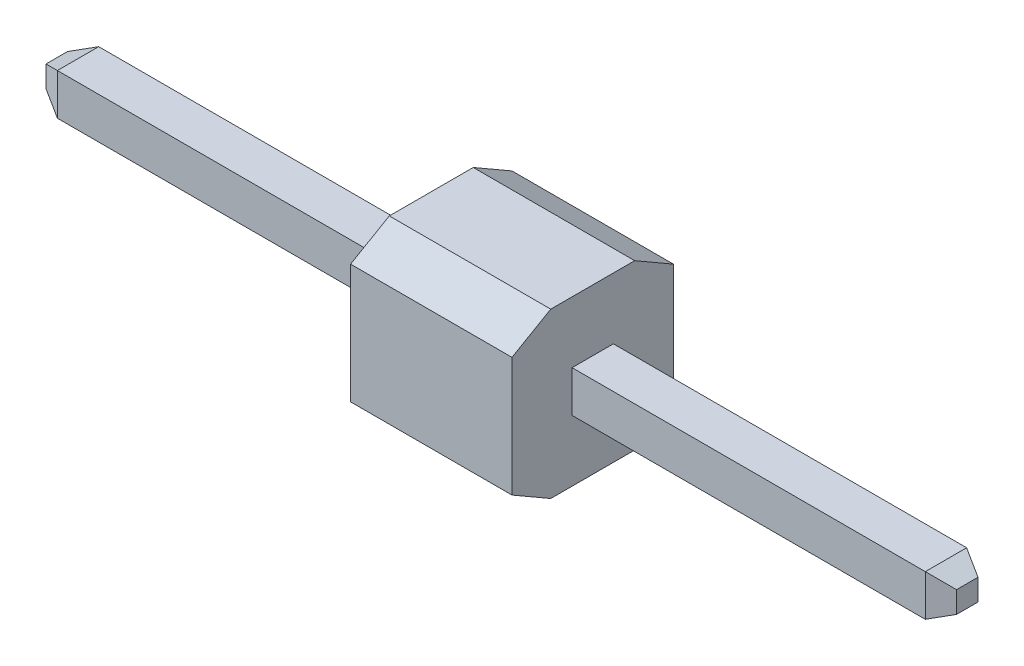
ISO-10303-21;
HEADER;
FILE_DESCRIPTION(('STEP AP214'),'2;1');
FILE_NAME('part.step','',(''),(''),'','','');
FILE_SCHEMA(('AUTOMOTIVE_DESIGN { 1 0 10303 214 1 1 1 1 }'));
ENDSEC;
DATA;
#1=APPLICATION_CONTEXT('core data for automotive mechanical design processes');
#2=APPLICATION_PROTOCOL_DEFINITION('international standard','automotive_design',2000,#1);
#3=PRODUCT_CONTEXT('',#1,'mechanical');
#4=PRODUCT('Part','Part','',(#3));
#5=PRODUCT_RELATED_PRODUCT_CATEGORY('part','',(#4));
#6=PRODUCT_DEFINITION_FORMATION('','',#4);
#7=PRODUCT_DEFINITION_CONTEXT('part definition',#1,'design');
#8=PRODUCT_DEFINITION('design','',#6,#7);
#9=PRODUCT_DEFINITION_SHAPE('','',#8);
#10=(LENGTH_UNIT() NAMED_UNIT(*) SI_UNIT(.MILLI.,.METRE.));
#11=(NAMED_UNIT(*) PLANE_ANGLE_UNIT() SI_UNIT($,.RADIAN.));
#12=(NAMED_UNIT(*) SI_UNIT($,.STERADIAN.) SOLID_ANGLE_UNIT());
#13=UNCERTAINTY_MEASURE_WITH_UNIT(LENGTH_MEASURE(1.E-05),#10,'distance_accuracy_value','');
#14=(GEOMETRIC_REPRESENTATION_CONTEXT(3) GLOBAL_UNCERTAINTY_ASSIGNED_CONTEXT((#13)) GLOBAL_UNIT_ASSIGNED_CONTEXT((#10,
#11,#12)) REPRESENTATION_CONTEXT('',''));
#15=CARTESIAN_POINT('',(0.,0.,0.));
#16=DIRECTION('',(0.,0.,1.));
#17=DIRECTION('',(1.,0.,0.));
#18=AXIS2_PLACEMENT_3D('',#15,#16,#17);
#19=CARTESIAN_POINT('',(5.42105009956526,-7.30287855189696,-2.6299975882472));
#20=DIRECTION('',(1.,-9.93476518829084E-08,4.37113882867379E-08));
#21=DIRECTION('',(-9.93476589883358E-08,-1.,8.74227765734759E-08));
#22=AXIS2_PLACEMENT_3D('',#19,#20,#21);
#23=PLANE('',#22);
#24=DIRECTION('',(-1.18186619959243E-08,-0.500000075710538,-0.866025360072935));
#25=VECTOR('',#24,1.);
#26=CARTESIAN_POINT('',(5.42104990739065,-8.54646825312919,-1.05999747952913));
#27=LINE('',#26,#25);
#28=CARTESIAN_POINT('',(5.42104990739065,-8.54646825312919,-1.05999747952913));
#29=VERTEX_POINT('',#28);
#30=CARTESIAN_POINT('',(5.42104989920244,-8.89287846709686,-1.65999744924499));
#31=VERTEX_POINT('',#30);
#32=EDGE_CURVE('E11',#29,#31,#27,.T.);
#33=ORIENTED_EDGE('',*,*,#32,.T.);
#34=DIRECTION('',(4.37113811813104E-08,-8.74227842254741E-08,-0.999999999999995));
#35=VECTOR('',#34,1.);
#36=CARTESIAN_POINT('',(5.42104989920244,-8.89287846709686,-1.65999744924499));
#37=LINE('',#36,#35);
#38=CARTESIAN_POINT('',(5.42104995602724,-8.89287858074648,-2.95999744924499));
#39=VERTEX_POINT('',#38);
#40=EDGE_CURVE('E304',#31,#39,#37,.T.);
#41=ORIENTED_EDGE('',*,*,#40,.T.);
#42=DIRECTION('',(8.75289950709516E-08,0.499999924289837,-0.866025447495713));
#43=VECTOR('',#42,1.);
#44=CARTESIAN_POINT('',(5.42104995602724,-8.89287858074648,-2.95999744924499));
#45=LINE('',#44,#43);
#46=CARTESIAN_POINT('',(5.4210500166691,-8.54646847168615,-3.55999747952913));
#47=VERTEX_POINT('',#46);
#48=EDGE_CURVE('E296',#39,#47,#45,.T.);
#49=ORIENTED_EDGE('',*,*,#48,.T.);
#50=DIRECTION('',(9.93476593243697E-08,0.999999999999991,-8.74227764821842E-08));
#51=VECTOR('',#50,1.);
#52=CARTESIAN_POINT('',(5.4210500166691,-8.54646847168615,-3.55999747952913));
#53=LINE('',#52,#51);
#54=CARTESIAN_POINT('',(5.42105020018208,-6.69928879471415,-3.5599976410147));
#55=VERTEX_POINT('',#54);
#56=EDGE_CURVE('E281',#47,#55,#53,.T.);
#57=ORIENTED_EDGE('',*,*,#56,.T.);
#58=DIRECTION('',(-1.18186632778994E-08,-0.500000075710539,-0.866025360072934));
#59=VECTOR('',#58,1.);
#60=CARTESIAN_POINT('',(5.42105020837029,-6.35287858074648,-2.95999767129884));
#61=LINE('',#60,#59);
#62=CARTESIAN_POINT('',(5.42105020837029,-6.35287858074648,-2.95999767129884));
#63=VERTEX_POINT('',#62);
#64=EDGE_CURVE('E265',#63,#55,#61,.T.);
#65=ORIENTED_EDGE('',*,*,#64,.F.);
#66=DIRECTION('',(4.37113811813104E-08,-8.74227835422599E-08,-0.999999999999995));
#67=VECTOR('',#66,1.);
#68=CARTESIAN_POINT('',(5.42105015154549,-6.35287846709686,-1.65999767129884));
#69=LINE('',#68,#67);
#70=CARTESIAN_POINT('',(5.42105015154549,-6.35287846709686,-1.65999767129884));
#71=VERTEX_POINT('',#70);
#72=EDGE_CURVE('E248',#71,#63,#69,.T.);
#73=ORIENTED_EDGE('',*,*,#72,.F.);
#74=DIRECTION('',(8.75289963529268E-08,0.499999924289837,-0.866025447495713));
#75=VECTOR('',#74,1.);
#76=CARTESIAN_POINT('',(5.42105009090363,-6.69928857615719,-1.0599976410147));
#77=LINE('',#76,#75);
#78=CARTESIAN_POINT('',(5.42105009090363,-6.69928857615719,-1.0599976410147));
#79=VERTEX_POINT('',#78);
#80=EDGE_CURVE('E242',#79,#71,#77,.T.);
#81=ORIENTED_EDGE('',*,*,#80,.F.);
#82=DIRECTION('',(9.93476593243697E-08,0.999999999999991,-8.74227763619768E-08));
#83=VECTOR('',#82,1.);
#84=CARTESIAN_POINT('',(5.42104990739065,-8.54646825312919,-1.05999747952913));
#85=LINE('',#84,#83);
#86=EDGE_CURVE('E236',#29,#79,#85,.T.);
#87=ORIENTED_EDGE('',*,*,#86,.F.);
#88=EDGE_LOOP('',(#33,#41,#49,#57,#65,#73,#81,#87));
#89=FACE_BOUND('',#88,.T.);
#90=DIRECTION('',(-4.37113817364219E-08,8.74227842895255E-08,0.999999999999995));
#91=VECTOR('',#90,1.);
#92=CARTESIAN_POINT('',(5.42105003598276,-7.94287855189696,-2.62999753229663));
#93=LINE('',#92,#91);
#94=CARTESIAN_POINT('',(5.42105003598276,-7.94287855189696,-2.62999753229663));
#95=VERTEX_POINT('',#94);
#96=CARTESIAN_POINT('',(5.42105000800747,-7.94287849594638,-1.98999753229663));
#97=VERTEX_POINT('',#96);
#98=EDGE_CURVE('E302',#95,#97,#93,.T.);
#99=ORIENTED_EDGE('',*,*,#98,.T.);
#100=DIRECTION('',(-9.93476592658907E-08,-0.999999999999991,8.74227763097972E-08));
#101=VECTOR('',#100,1.);
#102=CARTESIAN_POINT('',(5.42105007158997,-7.30287849594638,-1.9899975882472));
#103=LINE('',#102,#101);
#104=CARTESIAN_POINT('',(5.42105007158997,-7.30287849594638,-1.9899975882472));
#105=VERTEX_POINT('',#104);
#106=EDGE_CURVE('E293',#105,#97,#103,.T.);
#107=ORIENTED_EDGE('',*,*,#106,.F.);
#108=DIRECTION('',(-4.37113817364219E-08,8.74227842895255E-08,0.999999999999995));
#109=VECTOR('',#108,1.);
#110=CARTESIAN_POINT('',(5.42105009956526,-7.30287855189696,-2.6299975882472));
#111=LINE('',#110,#109);
#112=CARTESIAN_POINT('',(5.42105009956526,-7.30287855189696,-2.6299975882472));
#113=VERTEX_POINT('',#112);
#114=EDGE_CURVE('E278',#113,#105,#111,.T.);
#115=ORIENTED_EDGE('',*,*,#114,.F.);
#116=DIRECTION('',(-9.93476592658907E-08,-0.999999999999991,8.74227766567419E-08));
#117=VECTOR('',#116,1.);
#118=CARTESIAN_POINT('',(5.42105009956526,-7.30287855189696,-2.6299975882472));
#119=LINE('',#118,#117);
#120=EDGE_CURVE('E263',#113,#95,#119,.T.);
#121=ORIENTED_EDGE('',*,*,#120,.T.);
#122=EDGE_LOOP('',(#99,#107,#115,#121));
#123=FACE_BOUND('',#122,.T.);
#124=ADVANCED_FACE('F17',(#89,#123),#23,.T.);
#125=CARTESIAN_POINT('',(2.92105009956526,-7.30287830352783,-2.62999769752567));
#126=DIRECTION('',(1.,-9.93476518829084E-08,4.37113882867379E-08));
#127=DIRECTION('',(-9.93476589883358E-08,-1.,8.74227765734759E-08));
#128=AXIS2_PLACEMENT_3D('',#125,#126,#127);
#129=PLANE('',#128);
#130=DIRECTION('',(-1.18186626369119E-08,-0.500000075710538,-0.866025360072935));
#131=VECTOR('',#130,1.);
#132=CARTESIAN_POINT('',(2.92104990739065,-8.54646800476006,-1.0599975888076));
#133=LINE('',#132,#131);
#134=CARTESIAN_POINT('',(2.92104990739065,-8.54646800476006,-1.0599975888076));
#135=VERTEX_POINT('',#134);
#136=CARTESIAN_POINT('',(2.92104989920244,-8.89287821872773,-1.65999755852346));
#137=VERTEX_POINT('',#136);
#138=EDGE_CURVE('E24',#135,#137,#133,.T.);
#139=ORIENTED_EDGE('',*,*,#138,.F.);
#140=DIRECTION('',(9.9347659083955E-08,0.999999999999991,-8.74227763619768E-08));
#141=VECTOR('',#140,1.);
#142=CARTESIAN_POINT('',(2.92104990739065,-8.54646800476006,-1.0599975888076));
#143=LINE('',#142,#141);
#144=CARTESIAN_POINT('',(2.92105009090363,-6.69928832778806,-1.05999775029317));
#145=VERTEX_POINT('',#144);
#146=EDGE_CURVE('E300',#135,#145,#143,.T.);
#147=ORIENTED_EDGE('',*,*,#146,.T.);
#148=DIRECTION('',(8.75289963529268E-08,0.499999924289837,-0.866025447495713));
#149=VECTOR('',#148,1.);
#150=CARTESIAN_POINT('',(2.92105009090363,-6.69928832778806,-1.05999775029317));
#151=LINE('',#150,#149);
#152=CARTESIAN_POINT('',(2.92105015154549,-6.35287821872773,-1.65999778057731));
#153=VERTEX_POINT('',#152);
#154=EDGE_CURVE('E286',#145,#153,#151,.T.);
#155=ORIENTED_EDGE('',*,*,#154,.T.);
#156=DIRECTION('',(4.37113811813104E-08,-8.74227835422599E-08,-0.999999999999995));
#157=VECTOR('',#156,1.);
#158=CARTESIAN_POINT('',(2.92105015154549,-6.35287821872773,-1.65999778057731));
#159=LINE('',#158,#157);
#160=CARTESIAN_POINT('',(2.92105020837029,-6.35287833237735,-2.95999778057731));
#161=VERTEX_POINT('',#160);
#162=EDGE_CURVE('E271',#153,#161,#159,.T.);
#163=ORIENTED_EDGE('',*,*,#162,.T.);
#164=DIRECTION('',(-1.18186632778994E-08,-0.500000075710539,-0.866025360072934));
#165=VECTOR('',#164,1.);
#166=CARTESIAN_POINT('',(2.92105020837029,-6.35287833237735,-2.95999778057731));
#167=LINE('',#166,#165);
#168=CARTESIAN_POINT('',(2.92105020018208,-6.69928854634502,-3.55999775029317));
#169=VERTEX_POINT('',#168);
#170=EDGE_CURVE('E253',#161,#169,#167,.T.);
#171=ORIENTED_EDGE('',*,*,#170,.T.);
#172=DIRECTION('',(9.9347659083955E-08,0.999999999999991,-8.74227764821842E-08));
#173=VECTOR('',#172,1.);
#174=CARTESIAN_POINT('',(2.9210500166691,-8.54646822331702,-3.5599975888076));
#175=LINE('',#174,#173);
#176=CARTESIAN_POINT('',(2.9210500166691,-8.54646822331702,-3.5599975888076));
#177=VERTEX_POINT('',#176);
#178=EDGE_CURVE('E261',#177,#169,#175,.T.);
#179=ORIENTED_EDGE('',*,*,#178,.F.);
#180=DIRECTION('',(8.75289957119392E-08,0.499999924289837,-0.866025447495713));
#181=VECTOR('',#180,1.);
#182=CARTESIAN_POINT('',(2.92104995602724,-8.89287833237735,-2.95999755852346));
#183=LINE('',#182,#181);
#184=CARTESIAN_POINT('',(2.92104995602724,-8.89287833237735,-2.95999755852346));
#185=VERTEX_POINT('',#184);
#186=EDGE_CURVE('E276',#185,#177,#183,.T.);
#187=ORIENTED_EDGE('',*,*,#186,.F.);
#188=DIRECTION('',(4.37113811813104E-08,-8.74227842254741E-08,-0.999999999999995));
#189=VECTOR('',#188,1.);
#190=CARTESIAN_POINT('',(2.92104989920244,-8.89287821872773,-1.65999755852346));
#191=LINE('',#190,#189);
#192=EDGE_CURVE('E291',#137,#185,#191,.T.);
#193=ORIENTED_EDGE('',*,*,#192,.F.);
#194=EDGE_LOOP('',(#139,#147,#155,#163,#171,#179,#187,#193));
#195=FACE_BOUND('',#194,.T.);
#196=DIRECTION('',(-9.93476592658907E-08,-0.999999999999991,8.74227763097972E-08));
#197=VECTOR('',#196,1.);
#198=CARTESIAN_POINT('',(2.92105007158997,-7.30287824757725,-1.98999769752567));
#199=LINE('',#198,#197);
#200=CARTESIAN_POINT('',(2.92105007158997,-7.30287824757725,-1.98999769752567));
#201=VERTEX_POINT('',#200);
#202=CARTESIAN_POINT('',(2.92105000800747,-7.94287824757725,-1.9899976415751));
#203=VERTEX_POINT('',#202);
#204=EDGE_CURVE('E298',#201,#203,#199,.T.);
#205=ORIENTED_EDGE('',*,*,#204,.T.);
#206=DIRECTION('',(-4.37113817364219E-08,8.74227842895255E-08,0.999999999999995));
#207=VECTOR('',#206,1.);
#208=CARTESIAN_POINT('',(2.92105003598276,-7.94287830352783,-2.6299976415751));
#209=LINE('',#208,#207);
#210=CARTESIAN_POINT('',(2.92105003598276,-7.94287830352783,-2.6299976415751));
#211=VERTEX_POINT('',#210);
#212=EDGE_CURVE('E283',#211,#203,#209,.T.);
#213=ORIENTED_EDGE('',*,*,#212,.F.);
#214=DIRECTION('',(-9.93476585720013E-08,-0.999999999999991,8.74227766567419E-08));
#215=VECTOR('',#214,1.);
#216=CARTESIAN_POINT('',(2.92105009956526,-7.30287830352783,-2.62999769752567));
#217=LINE('',#216,#215);
#218=CARTESIAN_POINT('',(2.92105009956526,-7.30287830352783,-2.62999769752567));
#219=VERTEX_POINT('',#218);
#220=EDGE_CURVE('E268',#219,#211,#217,.T.);
#221=ORIENTED_EDGE('',*,*,#220,.F.);
#222=DIRECTION('',(-4.37113810425325E-08,8.74227842895255E-08,0.999999999999995));
#223=VECTOR('',#222,1.);
#224=CARTESIAN_POINT('',(2.92105009956526,-7.30287830352783,-2.62999769752567));
#225=LINE('',#224,#223);
#226=EDGE_CURVE('E251',#219,#201,#225,.T.);
#227=ORIENTED_EDGE('',*,*,#226,.T.);
#228=EDGE_LOOP('',(#205,#213,#221,#227));
#229=FACE_BOUND('',#228,.T.);
#230=ADVANCED_FACE('F314',(#195,#229),#129,.F.);
#231=CARTESIAN_POINT('',(5.42104990739065,-8.54646825312919,-1.05999747952913));
#232=DIRECTION('',(1.07893287081065E-07,0.866025360072937,-0.500000075710535));
#233=DIRECTION('',(1.18186629566715E-08,0.500000075710542,0.866025360072941));
#234=AXIS2_PLACEMENT_3D('',#231,#232,#233);
#235=PLANE('',#234);
#236=ORIENTED_EDGE('',*,*,#138,.T.);
#237=DIRECTION('',(-0.999999999999994,9.93476518829078E-08,-4.37113883755555E-08));
#238=VECTOR('',#237,1.);
#239=CARTESIAN_POINT('',(5.42104989920244,-8.89287846709686,-1.65999744924499));
#240=LINE('',#239,#238);
#241=EDGE_CURVE('E288',#31,#137,#240,.T.);
#242=ORIENTED_EDGE('',*,*,#241,.F.);
#243=ORIENTED_EDGE('',*,*,#32,.F.);
#244=DIRECTION('',(-0.999999999999994,9.93476518829078E-08,-4.3711388109102E-08));
#245=VECTOR('',#244,1.);
#246=CARTESIAN_POINT('',(5.42104990739065,-8.54646825312919,-1.05999747952913));
#247=LINE('',#246,#245);
#248=EDGE_CURVE('E256',#29,#135,#247,.T.);
#249=ORIENTED_EDGE('',*,*,#248,.T.);
#250=EDGE_LOOP('',(#236,#242,#243,#249));
#251=FACE_BOUND('',#250,.T.);
#252=ADVANCED_FACE('F306',(#251),#235,.F.);
#253=CARTESIAN_POINT('',(5.42104989920244,-8.89287846709686,-1.65999744924499));
#254=DIRECTION('',(9.93476589883358E-08,1.,-8.74227765734759E-08));
#255=DIRECTION('',(1.,-9.93476518829084E-08,4.37113882867379E-08));
#256=AXIS2_PLACEMENT_3D('',#253,#254,#255);
#257=PLANE('',#256);
#258=ORIENTED_EDGE('',*,*,#192,.T.);
#259=DIRECTION('',(-0.999999999999994,9.93476518829078E-08,-4.37113882867377E-08));
#260=VECTOR('',#259,1.);
#261=CARTESIAN_POINT('',(5.42104995602724,-8.89287858074648,-2.95999744924499));
#262=LINE('',#261,#260);
#263=EDGE_CURVE('E273',#39,#185,#262,.T.);
#264=ORIENTED_EDGE('',*,*,#263,.F.);
#265=ORIENTED_EDGE('',*,*,#40,.F.);
#266=ORIENTED_EDGE('',*,*,#241,.T.);
#267=EDGE_LOOP('',(#258,#264,#265,#266));
#268=FACE_BOUND('',#267,.T.);
#269=ADVANCED_FACE('F311',(#268),#257,.F.);
#270=CARTESIAN_POINT('',(5.42104995602724,-8.89287858074648,-2.95999744924499));
#271=DIRECTION('',(6.41819058997377E-08,0.866025447495721,0.499999924289845));
#272=DIRECTION('',(-8.7528996031702E-08,-0.499999924289838,0.866025447495717));
#273=AXIS2_PLACEMENT_3D('',#270,#271,#272);
#274=PLANE('',#273);
#275=ORIENTED_EDGE('',*,*,#186,.T.);
#276=DIRECTION('',(-0.999999999999994,9.93476518829078E-08,-4.37113882867377E-08));
#277=VECTOR('',#276,1.);
#278=CARTESIAN_POINT('',(5.4210500166691,-8.54646847168615,-3.55999747952913));
#279=LINE('',#278,#277);
#280=EDGE_CURVE('E258',#47,#177,#279,.T.);
#281=ORIENTED_EDGE('',*,*,#280,.F.);
#282=ORIENTED_EDGE('',*,*,#48,.F.);
#283=ORIENTED_EDGE('',*,*,#263,.T.);
#284=EDGE_LOOP('',(#275,#281,#282,#283));
#285=FACE_BOUND('',#284,.T.);
#286=ADVANCED_FACE('F319',(#285),#274,.F.);
#287=CARTESIAN_POINT('',(5.4210500166691,-8.54646847168615,-3.55999747952913));
#288=DIRECTION('',(-4.37113811813106E-08,8.74227836789032E-08,1.));
#289=DIRECTION('',(-1.,9.93476518829084E-08,-4.37113882867379E-08));
#290=AXIS2_PLACEMENT_3D('',#287,#288,#289);
#291=PLANE('',#290);
#292=ORIENTED_EDGE('',*,*,#178,.T.);
#293=DIRECTION('',(-0.999999999999994,9.93476518829078E-08,-4.37113882867377E-08));
#294=VECTOR('',#293,1.);
#295=CARTESIAN_POINT('',(5.42105020018208,-6.69928879471415,-3.5599976410147));
#296=LINE('',#295,#294);
#297=EDGE_CURVE('E245',#55,#169,#296,.T.);
#298=ORIENTED_EDGE('',*,*,#297,.F.);
#299=ORIENTED_EDGE('',*,*,#56,.F.);
#300=ORIENTED_EDGE('',*,*,#280,.T.);
#301=EDGE_LOOP('',(#292,#298,#299,#300));
#302=FACE_BOUND('',#301,.T.);
#303=ADVANCED_FACE('F326',(#302),#291,.F.);
#304=CARTESIAN_POINT('',(5.42105020837029,-6.35287858074648,-2.95999767129884));
#305=DIRECTION('',(1.07893287081065E-07,0.866025360072937,-0.500000075710535));
#306=DIRECTION('',(1.18186629566715E-08,0.500000075710542,0.866025360072941));
#307=AXIS2_PLACEMENT_3D('',#304,#305,#306);
#308=PLANE('',#307);
#309=ORIENTED_EDGE('',*,*,#170,.F.);
#310=DIRECTION('',(-0.999999999999994,9.93476522381792E-08,-4.37113882867377E-08));
#311=VECTOR('',#310,1.);
#312=CARTESIAN_POINT('',(5.42105020837029,-6.35287858074648,-2.95999767129884));
#313=LINE('',#312,#311);
#314=EDGE_CURVE('E239',#63,#161,#313,.T.);
#315=ORIENTED_EDGE('',*,*,#314,.F.);
#316=ORIENTED_EDGE('',*,*,#64,.T.);
#317=ORIENTED_EDGE('',*,*,#297,.T.);
#318=EDGE_LOOP('',(#309,#315,#316,#317));
#319=FACE_BOUND('',#318,.T.);
#320=ADVANCED_FACE('F329',(#319),#308,.T.);
#321=CARTESIAN_POINT('',(5.42105015154549,-6.35287846709686,-1.65999767129884));
#322=DIRECTION('',(9.93476589883358E-08,1.,-8.74227765734759E-08));
#323=DIRECTION('',(1.,-9.93476518829084E-08,4.37113882867379E-08));
#324=AXIS2_PLACEMENT_3D('',#321,#322,#323);
#325=PLANE('',#324);
#326=ORIENTED_EDGE('',*,*,#162,.F.);
#327=DIRECTION('',(-0.999999999999994,9.93476522381792E-08,-4.37113884643734E-08));
#328=VECTOR('',#327,1.);
#329=CARTESIAN_POINT('',(5.42105015154549,-6.35287846709686,-1.65999767129884));
#330=LINE('',#329,#328);
#331=EDGE_CURVE('E233',#71,#153,#330,.T.);
#332=ORIENTED_EDGE('',*,*,#331,.F.);
#333=ORIENTED_EDGE('',*,*,#72,.T.);
#334=ORIENTED_EDGE('',*,*,#314,.T.);
#335=EDGE_LOOP('',(#326,#332,#333,#334));
#336=FACE_BOUND('',#335,.T.);
#337=ADVANCED_FACE('F333',(#336),#325,.T.);
#338=CARTESIAN_POINT('',(5.42105009090363,-6.69928857615719,-1.0599976410147));
#339=DIRECTION('',(6.41819058997377E-08,0.866025447495721,0.499999924289845));
#340=DIRECTION('',(-8.7528996031702E-08,-0.499999924289838,0.866025447495717));
#341=AXIS2_PLACEMENT_3D('',#338,#339,#340);
#342=PLANE('',#341);
#343=ORIENTED_EDGE('',*,*,#154,.F.);
#344=DIRECTION('',(-0.999999999999994,9.93476518829078E-08,-4.3711388109102E-08));
#345=VECTOR('',#344,1.);
#346=CARTESIAN_POINT('',(5.42105009090363,-6.69928857615719,-1.0599976410147));
#347=LINE('',#346,#345);
#348=EDGE_CURVE('E230',#79,#145,#347,.T.);
#349=ORIENTED_EDGE('',*,*,#348,.F.);
#350=ORIENTED_EDGE('',*,*,#80,.T.);
#351=ORIENTED_EDGE('',*,*,#331,.T.);
#352=EDGE_LOOP('',(#343,#349,#350,#351));
#353=FACE_BOUND('',#352,.T.);
#354=ADVANCED_FACE('F337',(#353),#342,.T.);
#355=CARTESIAN_POINT('',(5.42104990739065,-8.54646825312919,-1.05999747952913));
#356=DIRECTION('',(-4.37113811813106E-08,8.74227835615132E-08,1.));
#357=DIRECTION('',(-9.93476589883358E-08,-1.,8.74227764560859E-08));
#358=AXIS2_PLACEMENT_3D('',#355,#356,#357);
#359=PLANE('',#358);
#360=ORIENTED_EDGE('',*,*,#146,.F.);
#361=ORIENTED_EDGE('',*,*,#248,.F.);
#362=ORIENTED_EDGE('',*,*,#86,.T.);
#363=ORIENTED_EDGE('',*,*,#348,.T.);
#364=EDGE_LOOP('',(#360,#361,#362,#363));
#365=FACE_BOUND('',#364,.T.);
#366=ADVANCED_FACE('F339',(#365),#359,.T.);
#367=CARTESIAN_POINT('',(-2.87894990043474,-7.30287772731145,-2.62999795105173));
#368=DIRECTION('',(-1.,9.93476518829084E-08,-4.37113882867379E-08));
#369=DIRECTION('',(9.93476589883358E-08,1.,-8.74227765734759E-08));
#370=AXIS2_PLACEMENT_3D('',#367,#368,#369);
#371=PLANE('',#370);
#372=DIRECTION('',(9.93476581453995E-08,0.999999999999991,-8.74227774760709E-08));
#373=VECTOR('',#372,1.);
#374=CARTESIAN_POINT('',(-2.87894996997838,-7.78899615762262,-2.1438794357449));
#375=LINE('',#374,#373);
#376=CARTESIAN_POINT('',(-2.87894996997838,-7.78899615762262,-2.1438794357449));
#377=VERTEX_POINT('',#376);
#378=CARTESIAN_POINT('',(-2.87894993697142,-7.45675921200462,-2.14387946478998));
#379=VERTEX_POINT('',#378);
#380=EDGE_CURVE('E228',#377,#379,#375,.T.);
#381=ORIENTED_EDGE('',*,*,#380,.T.);
#382=DIRECTION('',(4.37113793813867E-08,-8.74227801493995E-08,-0.999999999999995));
#383=VECTOR('',#382,1.);
#384=CARTESIAN_POINT('',(-2.87894993697142,-7.45675921200462,-2.14387946478998));
#385=LINE('',#384,#383);
#386=CARTESIAN_POINT('',(-2.87894992244889,-7.4567592410497,-2.47611641040798));
#387=VERTEX_POINT('',#386);
#388=EDGE_CURVE('E223',#379,#387,#385,.T.);
#389=ORIENTED_EDGE('',*,*,#388,.T.);
#390=DIRECTION('',(-9.93476608187277E-08,-0.999999999999991,8.74227761394067E-08));
#391=VECTOR('',#390,1.);
#392=CARTESIAN_POINT('',(-2.87894992244889,-7.4567592410497,-2.47611641040798));
#393=LINE('',#392,#391);
#394=CARTESIAN_POINT('',(-2.87894995545585,-7.7889961866677,-2.4761163813629));
#395=VERTEX_POINT('',#394);
#396=EDGE_CURVE('E215',#387,#395,#393,.T.);
#397=ORIENTED_EDGE('',*,*,#396,.T.);
#398=DIRECTION('',(-4.37113767080584E-08,8.74227828227278E-08,0.999999999999995));
#399=VECTOR('',#398,1.);
#400=CARTESIAN_POINT('',(-2.87894995545585,-7.7889961866677,-2.4761163813629));
#401=LINE('',#400,#399);
#402=EDGE_CURVE('E207',#395,#377,#401,.T.);
#403=ORIENTED_EDGE('',*,*,#402,.T.);
#404=EDGE_LOOP('',(#381,#389,#397,#403));
#405=FACE_BOUND('',#404,.T.);
#406=ADVANCED_FACE('F341',(#405),#371,.T.);
#407=CARTESIAN_POINT('',(-2.87894990043474,-7.30287772731145,-2.62999795105173));
#408=DIRECTION('',(9.93476589883358E-08,1.,-8.74227764510112E-08));
#409=DIRECTION('',(-4.37113811813106E-08,8.74227835564385E-08,1.));
#410=AXIS2_PLACEMENT_3D('',#407,#408,#409);
#411=PLANE('',#410);
#412=DIRECTION('',(0.999999999999994,-9.93476522661073E-08,4.37113882769953E-08));
#413=VECTOR('',#412,1.);
#414=CARTESIAN_POINT('',(-2.54894990043474,-7.30287776009618,-2.62999793662697));
#415=LINE('',#414,#413);
#416=CARTESIAN_POINT('',(-2.54894990043474,-7.30287776009618,-2.62999793662697));
#417=VERTEX_POINT('',#416);
#418=EDGE_CURVE('E225',#417,#219,#415,.T.);
#419=ORIENTED_EDGE('',*,*,#418,.F.);
#420=DIRECTION('',(-4.37113817364219E-08,8.74227842895255E-08,0.999999999999995));
#421=VECTOR('',#420,1.);
#422=CARTESIAN_POINT('',(-2.54894990043474,-7.30287776009618,-2.62999793662697));
#423=LINE('',#422,#421);
#424=CARTESIAN_POINT('',(-2.54894992841003,-7.30287770414559,-1.98999793662697));
#425=VERTEX_POINT('',#424);
#426=EDGE_CURVE('E217',#417,#425,#423,.T.);
#427=ORIENTED_EDGE('',*,*,#426,.T.);
#428=DIRECTION('',(0.999999999999994,-9.93476522661073E-08,4.37113882364022E-08));
#429=VECTOR('',#428,1.);
#430=CARTESIAN_POINT('',(-2.54894992841003,-7.30287770414559,-1.98999793662697));
#431=LINE('',#430,#429);
#432=EDGE_CURVE('E220',#425,#201,#431,.T.);
#433=ORIENTED_EDGE('',*,*,#432,.T.);
#434=ORIENTED_EDGE('',*,*,#226,.F.);
#435=EDGE_LOOP('',(#419,#427,#433,#434));
#436=FACE_BOUND('',#435,.T.);
#437=ADVANCED_FACE('F348',(#436),#411,.T.);
#438=CARTESIAN_POINT('',(-2.87894992841003,-7.30287767136087,-1.98999795105173));
#439=DIRECTION('',(-4.37113811813106E-08,8.74227836789032E-08,1.));
#440=DIRECTION('',(-1.,9.93476518829084E-08,-4.37113882867379E-08));
#441=AXIS2_PLACEMENT_3D('',#438,#439,#440);
#442=PLANE('',#441);
#443=ORIENTED_EDGE('',*,*,#432,.F.);
#444=DIRECTION('',(-9.93476592658907E-08,-0.999999999999991,8.74227763097972E-08));
#445=VECTOR('',#444,1.);
#446=CARTESIAN_POINT('',(-2.54894992841003,-7.30287770414559,-1.98999793662697));
#447=LINE('',#446,#445);
#448=CARTESIAN_POINT('',(-2.54894999199253,-7.94287770414559,-1.98999788067639));
#449=VERTEX_POINT('',#448);
#450=EDGE_CURVE('E209',#425,#449,#447,.T.);
#451=ORIENTED_EDGE('',*,*,#450,.T.);
#452=DIRECTION('',(0.999999999999994,-9.93476517789893E-08,4.37113882364022E-08));
#453=VECTOR('',#452,1.);
#454=CARTESIAN_POINT('',(-2.54894999199253,-7.94287770414559,-1.98999788067639));
#455=LINE('',#454,#453);
#456=EDGE_CURVE('E212',#449,#203,#455,.T.);
#457=ORIENTED_EDGE('',*,*,#456,.T.);
#458=ORIENTED_EDGE('',*,*,#204,.F.);
#459=EDGE_LOOP('',(#443,#451,#457,#458));
#460=FACE_BOUND('',#459,.T.);
#461=ADVANCED_FACE('F424',(#460),#442,.T.);
#462=CARTESIAN_POINT('',(-2.87894996401724,-7.94287772731145,-2.62999789510115));
#463=DIRECTION('',(9.93476589883357E-08,1.,-8.74227764040693E-08));
#464=DIRECTION('',(-4.37113811813106E-08,8.74227835094966E-08,1.));
#465=AXIS2_PLACEMENT_3D('',#462,#463,#464);
#466=PLANE('',#465);
#467=ORIENTED_EDGE('',*,*,#456,.F.);
#468=DIRECTION('',(4.37113831242006E-08,-8.74227856773042E-08,-0.999999999999995));
#469=VECTOR('',#468,1.);
#470=CARTESIAN_POINT('',(-2.54894999199253,-7.94287770414559,-1.98999788067639));
#471=LINE('',#470,#469);
#472=CARTESIAN_POINT('',(-2.54894996401724,-7.94287776009618,-2.62999788067639));
#473=VERTEX_POINT('',#472);
#474=EDGE_CURVE('E201',#449,#473,#471,.T.);
#475=ORIENTED_EDGE('',*,*,#474,.T.);
#476=DIRECTION('',(0.999999999999994,-9.93476517789893E-08,4.37113883581816E-08));
#477=VECTOR('',#476,1.);
#478=CARTESIAN_POINT('',(-2.54894996401724,-7.94287776009618,-2.62999788067639));
#479=LINE('',#478,#477);
#480=EDGE_CURVE('E204',#473,#211,#479,.T.);
#481=ORIENTED_EDGE('',*,*,#480,.T.);
#482=ORIENTED_EDGE('',*,*,#212,.T.);
#483=EDGE_LOOP('',(#467,#475,#481,#482));
#484=FACE_BOUND('',#483,.T.);
#485=ADVANCED_FACE('F421',(#484),#466,.F.);
#486=CARTESIAN_POINT('',(-2.87894990043474,-7.30287772731145,-2.62999795105173));
#487=DIRECTION('',(-4.37113811813106E-08,8.74227836789032E-08,1.));
#488=DIRECTION('',(-1.,9.93476518829084E-08,-4.37113882867379E-08));
#489=AXIS2_PLACEMENT_3D('',#486,#487,#488);
#490=PLANE('',#489);
#491=ORIENTED_EDGE('',*,*,#480,.F.);
#492=DIRECTION('',(9.93476578781121E-08,0.999999999999991,-8.74227759628526E-08));
#493=VECTOR('',#492,1.);
#494=CARTESIAN_POINT('',(-2.54894996401724,-7.94287776009617,-2.62999788067639));
#495=LINE('',#494,#493);
#496=EDGE_CURVE('E196',#473,#417,#495,.T.);
#497=ORIENTED_EDGE('',*,*,#496,.T.);
#498=ORIENTED_EDGE('',*,*,#418,.T.);
#499=ORIENTED_EDGE('',*,*,#220,.T.);
#500=EDGE_LOOP('',(#491,#497,#498,#499));
#501=FACE_BOUND('',#500,.T.);
#502=ADVANCED_FACE('F376',(#501),#490,.F.);
#503=CARTESIAN_POINT('',(-2.87894990043474,-7.30287772731145,-2.62999795105173));
#504=DIRECTION('',(-4.37113811813106E-08,8.74227836789032E-08,1.));
#505=DIRECTION('',(-1.,9.93476518829084E-08,-4.37113882867379E-08));
#506=AXIS2_PLACEMENT_3D('',#503,#504,#505);
#507=PLANE('',#506);
#508=DIRECTION('',(0.999999999999994,-9.9347651941362E-08,4.37113882769953E-08));
#509=VECTOR('',#508,1.);
#510=CARTESIAN_POINT('',(5.42105009956526,-7.30287855189696,-2.6299975882472));
#511=LINE('',#510,#509);
#512=CARTESIAN_POINT('',(10.8910500995653,-7.30287909532862,-2.62999734914591));
#513=VERTEX_POINT('',#512);
#514=EDGE_CURVE('E199',#113,#513,#511,.T.);
#515=ORIENTED_EDGE('',*,*,#514,.T.);
#516=DIRECTION('',(-9.9347663429227E-08,-0.999999999999991,8.74227766567419E-08));
#517=VECTOR('',#516,1.);
#518=CARTESIAN_POINT('',(10.8910500995653,-7.30287909532862,-2.62999734914591));
#519=LINE('',#518,#517);
#520=CARTESIAN_POINT('',(10.8910500359828,-7.94287909532862,-2.62999729319533));
#521=VERTEX_POINT('',#520);
#522=EDGE_CURVE('E191',#513,#521,#519,.T.);
#523=ORIENTED_EDGE('',*,*,#522,.T.);
#524=DIRECTION('',(0.999999999999994,-9.9347651941362E-08,4.37113882769953E-08));
#525=VECTOR('',#524,1.);
#526=CARTESIAN_POINT('',(5.42105003598276,-7.94287855189696,-2.62999753229663));
#527=LINE('',#526,#525);
#528=EDGE_CURVE('E194',#95,#521,#527,.T.);
#529=ORIENTED_EDGE('',*,*,#528,.F.);
#530=ORIENTED_EDGE('',*,*,#120,.F.);
#531=EDGE_LOOP('',(#515,#523,#529,#530));
#532=FACE_BOUND('',#531,.T.);
#533=ADVANCED_FACE('F367',(#532),#507,.F.);
#534=CARTESIAN_POINT('',(-2.87894996401724,-7.94287772731145,-2.62999789510115));
#535=DIRECTION('',(9.93476589883357E-08,1.,-8.74227764040693E-08));
#536=DIRECTION('',(-4.37113811813106E-08,8.74227835094966E-08,1.));
#537=AXIS2_PLACEMENT_3D('',#534,#535,#536);
#538=PLANE('',#537);
#539=ORIENTED_EDGE('',*,*,#528,.T.);
#540=DIRECTION('',(-4.37113817364219E-08,8.74227842895255E-08,0.999999999999995));
#541=VECTOR('',#540,1.);
#542=CARTESIAN_POINT('',(10.8910500359828,-7.94287909532862,-2.62999729319533));
#543=LINE('',#542,#541);
#544=CARTESIAN_POINT('',(10.8910500080075,-7.94287903937804,-1.98999729319533));
#545=VERTEX_POINT('',#544);
#546=EDGE_CURVE('E186',#521,#545,#543,.T.);
#547=ORIENTED_EDGE('',*,*,#546,.T.);
#548=DIRECTION('',(0.999999999999994,-9.9347651941362E-08,4.37113881146227E-08));
#549=VECTOR('',#548,1.);
#550=CARTESIAN_POINT('',(5.42105000800747,-7.94287849594638,-1.98999753229663));
#551=LINE('',#550,#549);
#552=EDGE_CURVE('E189',#97,#545,#551,.T.);
#553=ORIENTED_EDGE('',*,*,#552,.F.);
#554=ORIENTED_EDGE('',*,*,#98,.F.);
#555=EDGE_LOOP('',(#539,#547,#553,#554));
#556=FACE_BOUND('',#555,.T.);
#557=ADVANCED_FACE('F364',(#556),#538,.F.);
#558=CARTESIAN_POINT('',(-2.87894992841003,-7.30287767136087,-1.98999795105173));
#559=DIRECTION('',(-4.37113811813106E-08,8.74227836789032E-08,1.));
#560=DIRECTION('',(-1.,9.93476518829084E-08,-4.37113882867379E-08));
#561=AXIS2_PLACEMENT_3D('',#558,#559,#560);
#562=PLANE('',#561);
#563=ORIENTED_EDGE('',*,*,#552,.T.);
#564=DIRECTION('',(9.93476578781121E-08,0.999999999999991,-8.7422776656742E-08));
#565=VECTOR('',#564,1.);
#566=CARTESIAN_POINT('',(10.8910500080075,-7.94287903937804,-1.98999729319533));
#567=LINE('',#566,#565);
#568=CARTESIAN_POINT('',(10.89105007159,-7.30287903937804,-1.98999734914591));
#569=VERTEX_POINT('',#568);
#570=EDGE_CURVE('E176',#545,#569,#567,.T.);
#571=ORIENTED_EDGE('',*,*,#570,.T.);
#572=DIRECTION('',(0.999999999999994,-9.9347651941362E-08,4.37113881146227E-08));
#573=VECTOR('',#572,1.);
#574=CARTESIAN_POINT('',(5.42105007158997,-7.30287849594638,-1.9899975882472));
#575=LINE('',#574,#573);
#576=EDGE_CURVE('E179',#105,#569,#575,.T.);
#577=ORIENTED_EDGE('',*,*,#576,.F.);
#578=ORIENTED_EDGE('',*,*,#106,.T.);
#579=EDGE_LOOP('',(#563,#571,#577,#578));
#580=FACE_BOUND('',#579,.T.);
#581=ADVANCED_FACE('F366',(#580),#562,.T.);
#582=CARTESIAN_POINT('',(-2.87894990043474,-7.30287772731145,-2.62999795105173));
#583=DIRECTION('',(9.93476589883358E-08,1.,-8.74227764510112E-08));
#584=DIRECTION('',(-4.37113811813106E-08,8.74227835564385E-08,1.));
#585=AXIS2_PLACEMENT_3D('',#582,#583,#584);
#586=PLANE('',#585);
#587=ORIENTED_EDGE('',*,*,#576,.T.);
#588=DIRECTION('',(4.37113817364219E-08,-8.74227842895255E-08,-0.999999999999995));
#589=VECTOR('',#588,1.);
#590=CARTESIAN_POINT('',(10.89105007159,-7.30287903937804,-1.98999734914591));
#591=LINE('',#590,#589);
#592=EDGE_CURVE('E167',#569,#513,#591,.T.);
#593=ORIENTED_EDGE('',*,*,#592,.T.);
#594=ORIENTED_EDGE('',*,*,#514,.F.);
#595=ORIENTED_EDGE('',*,*,#114,.T.);
#596=EDGE_LOOP('',(#587,#593,#594,#595));
#597=FACE_BOUND('',#596,.T.);
#598=ADVANCED_FACE('F373',(#597),#586,.T.);
#599=CARTESIAN_POINT('',(11.2210500995653,-7.30287912811334,-2.62999733472115));
#600=DIRECTION('',(-1.,9.93476518829084E-08,-4.37113882867379E-08));
#601=DIRECTION('',(9.93476589883358E-08,1.,-8.74227765734759E-08));
#602=AXIS2_PLACEMENT_3D('',#599,#600,#601);
#603=PLANE('',#602);
#604=DIRECTION('',(-9.93476581453995E-08,-0.999999999999991,8.74227761394067E-08));
#605=VECTOR('',#604,1.);
#606=CARTESIAN_POINT('',(11.2210500630286,-7.45676061280651,-2.1438788484594));
#607=LINE('',#606,#605);
#608=CARTESIAN_POINT('',(11.2210500630286,-7.45676061280651,-2.1438788484594));
#609=VERTEX_POINT('',#608);
#610=CARTESIAN_POINT('',(11.2210500300216,-7.78899755842451,-2.14387881941432));
#611=VERTEX_POINT('',#610);
#612=EDGE_CURVE('E153',#609,#611,#607,.T.);
#613=ORIENTED_EDGE('',*,*,#612,.T.);
#614=DIRECTION('',(4.37113820547149E-08,-8.74227854960561E-08,-0.999999999999995));
#615=VECTOR('',#614,1.);
#616=CARTESIAN_POINT('',(11.2210500300216,-7.78899755842451,-2.14387881941432));
#617=LINE('',#616,#615);
#618=CARTESIAN_POINT('',(11.2210500445442,-7.78899758746959,-2.47611576503232));
#619=VERTEX_POINT('',#618);
#620=EDGE_CURVE('E395',#611,#619,#617,.T.);
#621=ORIENTED_EDGE('',*,*,#620,.T.);
#622=DIRECTION('',(9.93476581453995E-08,0.999999999999991,-8.74227761394067E-08));
#623=VECTOR('',#622,1.);
#624=CARTESIAN_POINT('',(11.2210500445442,-7.78899758746959,-2.47611576503232));
#625=LINE('',#624,#623);
#626=CARTESIAN_POINT('',(11.2210500775511,-7.45676064185159,-2.4761157940774));
#627=VERTEX_POINT('',#626);
#628=EDGE_CURVE('E156',#619,#627,#625,.T.);
#629=ORIENTED_EDGE('',*,*,#628,.T.);
#630=DIRECTION('',(-4.37113874013715E-08,8.74227801493996E-08,0.999999999999995));
#631=VECTOR('',#630,1.);
#632=CARTESIAN_POINT('',(11.2210500775511,-7.45676064185159,-2.4761157940774));
#633=LINE('',#632,#631);
#634=EDGE_CURVE('E149',#627,#609,#633,.T.);
#635=ORIENTED_EDGE('',*,*,#634,.T.);
#636=EDGE_LOOP('',(#613,#621,#629,#635));
#637=FACE_BOUND('',#636,.T.);
#638=ADVANCED_FACE('F151',(#637),#603,.F.);
#639=CARTESIAN_POINT('',(-2.87894994872947,-7.78899620012045,-2.6299979085539));
#640=DIRECTION('',(-0.422618351780369,-0.906307745050466,6.07587120833484E-08));
#641=DIRECTION('',(4.37113811813106E-08,-8.74227835094966E-08,-1.));
#642=AXIS2_PLACEMENT_3D('',#639,#640,#641);
#643=PLANE('',#642);
#644=DIRECTION('',(0.83481707378875,-0.389281669540041,0.389281691158097));
#645=VECTOR('',#644,1.);
#646=CARTESIAN_POINT('',(-2.87894996997808,-7.78899615762229,-2.14387943574523));
#647=LINE('',#646,#645);
#648=EDGE_CURVE('E181',#377,#449,#647,.T.);
#649=ORIENTED_EDGE('',*,*,#648,.F.);
#650=ORIENTED_EDGE('',*,*,#402,.F.);
#651=DIRECTION('',(-0.834817107820822,0.389281737604206,0.389281550111905));
#652=VECTOR('',#651,1.);
#653=CARTESIAN_POINT('',(-2.54894996401702,-7.94287776009594,-2.62999788067616));
#654=LINE('',#653,#652);
#655=EDGE_CURVE('E404',#473,#395,#654,.T.);
#656=ORIENTED_EDGE('',*,*,#655,.F.);
#657=ORIENTED_EDGE('',*,*,#474,.F.);
#658=EDGE_LOOP('',(#649,#650,#656,#657));
#659=FACE_BOUND('',#658,.T.);
#660=ADVANCED_FACE('F418',(#659),#643,.T.);
#661=CARTESIAN_POINT('',(-2.87894990716112,-7.3028777138587,-2.47611642386073));
#662=DIRECTION('',(-0.422618222124847,-3.72458176658199E-08,-0.906307805509828));
#663=DIRECTION('',(9.93476589883358E-08,1.,-8.74227765734759E-08));
#664=AXIS2_PLACEMENT_3D('',#661,#662,#663);
#665=PLANE('',#664);
#666=ORIENTED_EDGE('',*,*,#655,.T.);
#667=ORIENTED_EDGE('',*,*,#396,.F.);
#668=DIRECTION('',(-0.834817185169258,-0.389281503665794,0.389281618176064));
#669=VECTOR('',#668,1.);
#670=CARTESIAN_POINT('',(-2.54894990043457,-7.30287776009636,-2.62999793662678));
#671=LINE('',#670,#669);
#672=EDGE_CURVE('E160',#417,#387,#671,.T.);
#673=ORIENTED_EDGE('',*,*,#672,.F.);
#674=ORIENTED_EDGE('',*,*,#496,.F.);
#675=EDGE_LOOP('',(#666,#667,#673,#674));
#676=FACE_BOUND('',#675,.T.);
#677=ADVANCED_FACE('F434',(#676),#665,.T.);
#678=CARTESIAN_POINT('',(-2.54894992841003,-7.30287770414559,-1.98999793662697));
#679=DIRECTION('',(0.422618301356777,-1.21218081559392E-07,-0.906307768563367));
#680=DIRECTION('',(-9.93476589883358E-08,-1.,8.74227765734759E-08));
#681=AXIS2_PLACEMENT_3D('',#678,#679,#680);
#682=PLANE('',#681);
#683=ORIENTED_EDGE('',*,*,#648,.T.);
#684=ORIENTED_EDGE('',*,*,#450,.F.);
#685=DIRECTION('',(0.834817151137183,0.38928157172996,0.389281623093937));
#686=VECTOR('',#685,1.);
#687=CARTESIAN_POINT('',(-2.87894993697133,-7.45675921200472,-2.14387946479007));
#688=LINE('',#687,#686);
#689=EDGE_CURVE('E170',#379,#425,#688,.T.);
#690=ORIENTED_EDGE('',*,*,#689,.F.);
#691=ORIENTED_EDGE('',*,*,#380,.F.);
#692=EDGE_LOOP('',(#683,#684,#690,#691));
#693=FACE_BOUND('',#692,.T.);
#694=ADVANCED_FACE('F413',(#693),#682,.F.);
#695=CARTESIAN_POINT('',(-2.54894990043474,-7.30287776009618,-2.62999793662697));
#696=DIRECTION('',(0.422618171701255,-0.906307829022729,9.770517399793E-08));
#697=DIRECTION('',(-4.37113811813106E-08,8.74227835564385E-08,1.));
#698=AXIS2_PLACEMENT_3D('',#695,#696,#697);
#699=PLANE('',#698);
#700=ORIENTED_EDGE('',*,*,#672,.T.);
#701=ORIENTED_EDGE('',*,*,#388,.F.);
#702=ORIENTED_EDGE('',*,*,#689,.T.);
#703=ORIENTED_EDGE('',*,*,#426,.F.);
#704=EDGE_LOOP('',(#700,#701,#702,#703));
#705=FACE_BOUND('',#704,.T.);
#706=ADVANCED_FACE('F429',(#705),#699,.F.);
#707=CARTESIAN_POINT('',(11.2210500842775,-7.45676065530434,-2.6299973212684));
#708=DIRECTION('',(0.422618351780369,0.906307745050466,-6.07587121258922E-08));
#709=DIRECTION('',(4.37113811813106E-08,-8.74227835564385E-08,-1.));
#710=AXIS2_PLACEMENT_3D('',#707,#708,#709);
#711=PLANE('',#710);
#712=DIRECTION('',(-0.834817107820823,0.389281737604205,0.389281550111904));
#713=VECTOR('',#712,1.);
#714=CARTESIAN_POINT('',(11.2210500630283,-7.45676061280684,-2.14387884845973));
#715=LINE('',#714,#713);
#716=EDGE_CURVE('E164',#609,#569,#715,.T.);
#717=ORIENTED_EDGE('',*,*,#716,.F.);
#718=ORIENTED_EDGE('',*,*,#634,.F.);
#719=DIRECTION('',(0.834817073788749,-0.38928166954004,0.389281691158098));
#720=VECTOR('',#719,1.);
#721=CARTESIAN_POINT('',(10.8910500995653,-7.30287909532862,-2.62999734914591));
#722=LINE('',#721,#720);
#723=EDGE_CURVE('E392',#513,#627,#722,.T.);
#724=ORIENTED_EDGE('',*,*,#723,.F.);
#725=ORIENTED_EDGE('',*,*,#592,.F.);
#726=EDGE_LOOP('',(#717,#718,#724,#725));
#727=FACE_BOUND('',#726,.T.);
#728=ADVANCED_FACE('F165',(#727),#711,.T.);
#729=CARTESIAN_POINT('',(10.8910500995653,-7.30287909532862,-2.62999734914591));
#730=DIRECTION('',(-0.422618301356777,1.21218081559392E-07,0.906307768563367));
#731=DIRECTION('',(-9.93476589883358E-08,-1.,8.74227765734759E-08));
#732=AXIS2_PLACEMENT_3D('',#729,#730,#731);
#733=PLANE('',#732);
#734=ORIENTED_EDGE('',*,*,#723,.T.);
#735=ORIENTED_EDGE('',*,*,#628,.F.);
#736=DIRECTION('',(0.834817151137182,0.389281571729962,0.389281623093935));
#737=VECTOR('',#736,1.);
#738=CARTESIAN_POINT('',(10.8910500359827,-7.94287909532858,-2.62999729319519));
#739=LINE('',#738,#737);
#740=EDGE_CURVE('E389',#521,#619,#739,.T.);
#741=ORIENTED_EDGE('',*,*,#740,.F.);
#742=ORIENTED_EDGE('',*,*,#522,.F.);
#743=EDGE_LOOP('',(#734,#735,#741,#742));
#744=FACE_BOUND('',#743,.T.);
#745=ADVANCED_FACE('F390',(#744),#733,.F.);
#746=CARTESIAN_POINT('',(11.2210500783163,-7.30287908561551,-2.14387886191215));
#747=DIRECTION('',(0.422618222124847,3.72458176658199E-08,0.906307805509828));
#748=DIRECTION('',(9.93476589883358E-08,1.,-8.74227765734759E-08));
#749=AXIS2_PLACEMENT_3D('',#746,#747,#748);
#750=PLANE('',#749);
#751=ORIENTED_EDGE('',*,*,#716,.T.);
#752=ORIENTED_EDGE('',*,*,#570,.F.);
#753=DIRECTION('',(-0.834817185169258,-0.389281503665795,0.389281618176063));
#754=VECTOR('',#753,1.);
#755=CARTESIAN_POINT('',(11.2210500300213,-7.78899755842418,-2.14387881941466));
#756=LINE('',#755,#754);
#757=EDGE_CURVE('E175',#611,#545,#756,.T.);
#758=ORIENTED_EDGE('',*,*,#757,.F.);
#759=ORIENTED_EDGE('',*,*,#612,.F.);
#760=EDGE_LOOP('',(#751,#752,#758,#759));
#761=FACE_BOUND('',#760,.T.);
#762=ADVANCED_FACE('F173',(#761),#750,.T.);
#763=CARTESIAN_POINT('',(10.8910500359828,-7.94287909532862,-2.62999729319533));
#764=DIRECTION('',(-0.422618171701255,0.906307829022729,-9.77051739553862E-08));
#765=DIRECTION('',(-4.37113811813106E-08,8.74227835094966E-08,1.));
#766=AXIS2_PLACEMENT_3D('',#763,#764,#765);
#767=PLANE('',#766);
#768=ORIENTED_EDGE('',*,*,#740,.T.);
#769=ORIENTED_EDGE('',*,*,#620,.F.);
#770=ORIENTED_EDGE('',*,*,#757,.T.);
#771=ORIENTED_EDGE('',*,*,#546,.F.);
#772=EDGE_LOOP('',(#768,#769,#770,#771));
#773=FACE_BOUND('',#772,.T.);
#774=ADVANCED_FACE('F394',(#773),#767,.F.);
#775=CLOSED_SHELL('',(#124,#230,#252,#269,#286,#303,#320,#337,#354,#366,#406,#437,#461,#485,
#502,#533,#557,#581,#598,#638,#660,#677,#694,#706,#728,#745,#762,#774));
#776=MANIFOLD_SOLID_BREP('B1',#775);
#777=ADVANCED_BREP_SHAPE_REPRESENTATION('',(#18,#776),#14);
#778=SHAPE_DEFINITION_REPRESENTATION(#9,#777);
ENDSEC;
END-ISO-10303-21;
